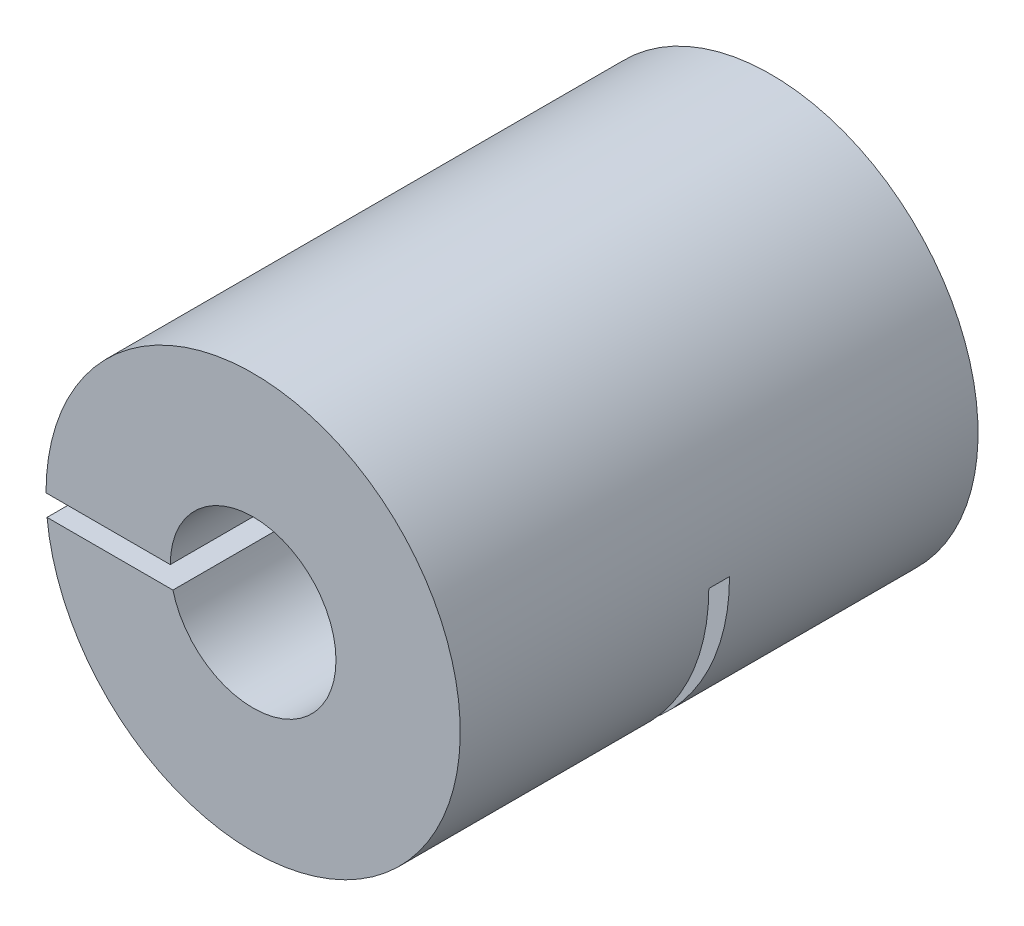
ISO-10303-21;
HEADER;
FILE_DESCRIPTION(('STEP AP214'),'2;1');
FILE_NAME('part.step','',(''),(''),'','','');
FILE_SCHEMA(('AUTOMOTIVE_DESIGN { 1 0 10303 214 1 1 1 1 }'));
ENDSEC;
DATA;
#1=APPLICATION_CONTEXT('core data for automotive mechanical design processes');
#2=APPLICATION_PROTOCOL_DEFINITION('international standard','automotive_design',2000,#1);
#3=PRODUCT_CONTEXT('',#1,'mechanical');
#4=PRODUCT('Part','Part','',(#3));
#5=PRODUCT_RELATED_PRODUCT_CATEGORY('part','',(#4));
#6=PRODUCT_DEFINITION_FORMATION('','',#4);
#7=PRODUCT_DEFINITION_CONTEXT('part definition',#1,'design');
#8=PRODUCT_DEFINITION('design','',#6,#7);
#9=PRODUCT_DEFINITION_SHAPE('','',#8);
#10=(LENGTH_UNIT() NAMED_UNIT(*) SI_UNIT(.MILLI.,.METRE.));
#11=(NAMED_UNIT(*) PLANE_ANGLE_UNIT() SI_UNIT($,.RADIAN.));
#12=(NAMED_UNIT(*) SI_UNIT($,.STERADIAN.) SOLID_ANGLE_UNIT());
#13=UNCERTAINTY_MEASURE_WITH_UNIT(LENGTH_MEASURE(1.E-05),#10,'distance_accuracy_value','');
#14=(GEOMETRIC_REPRESENTATION_CONTEXT(3) GLOBAL_UNCERTAINTY_ASSIGNED_CONTEXT((#13)) GLOBAL_UNIT_ASSIGNED_CONTEXT((#10,
#11,#12)) REPRESENTATION_CONTEXT('',''));
#15=CARTESIAN_POINT('',(0.,0.,0.));
#16=DIRECTION('',(0.,0.,1.));
#17=DIRECTION('',(1.,0.,0.));
#18=AXIS2_PLACEMENT_3D('',#15,#16,#17);
#19=CARTESIAN_POINT('',(0.,0.,0.));
#20=DIRECTION('',(0.,1.,0.));
#21=DIRECTION('',(0.,0.,1.));
#22=AXIS2_PLACEMENT_3D('',#19,#20,#21);
#23=PLANE('',#22);
#24=DIRECTION('',(-1.,0.,0.));
#25=VECTOR('',#24,1.);
#26=CARTESIAN_POINT('',(0.,0.,0.));
#27=LINE('',#26,#25);
#28=CARTESIAN_POINT('',(4.,0.,0.));
#29=VERTEX_POINT('',#28);
#30=CARTESIAN_POINT('',(2.5,0.,0.));
#31=VERTEX_POINT('',#30);
#32=EDGE_CURVE('E176',#29,#31,#27,.T.);
#33=ORIENTED_EDGE('',*,*,#32,.T.);
#34=DIRECTION('',(0.,0.,-1.));
#35=VECTOR('',#34,1.);
#36=CARTESIAN_POINT('',(2.5,0.,12.5));
#37=LINE('',#36,#35);
#38=CARTESIAN_POINT('',(2.5,0.,-0.5));
#39=VERTEX_POINT('',#38);
#40=EDGE_CURVE('E208',#31,#39,#37,.T.);
#41=ORIENTED_EDGE('',*,*,#40,.T.);
#42=DIRECTION('',(-1.,0.,0.));
#43=VECTOR('',#42,1.);
#44=CARTESIAN_POINT('',(-26.5245924460657,0.,-0.5));
#45=LINE('',#44,#43);
#46=CARTESIAN_POINT('',(10.,0.,-0.5));
#47=VERTEX_POINT('',#46);
#48=EDGE_CURVE('E146',#47,#39,#45,.T.);
#49=ORIENTED_EDGE('',*,*,#48,.F.);
#50=DIRECTION('',(0.,0.,1.));
#51=VECTOR('',#50,1.);
#52=CARTESIAN_POINT('',(10.,0.,-12.5));
#53=LINE('',#52,#51);
#54=CARTESIAN_POINT('',(9.99999999999999,0.,0.5));
#55=VERTEX_POINT('',#54);
#56=EDGE_CURVE('E158',#47,#55,#53,.T.);
#57=ORIENTED_EDGE('',*,*,#56,.T.);
#58=DIRECTION('',(1.,0.,0.));
#59=VECTOR('',#58,1.);
#60=CARTESIAN_POINT('',(-26.5245924460657,0.,0.5));
#61=LINE('',#60,#59);
#62=CARTESIAN_POINT('',(3.99999999999999,0.,0.5));
#63=VERTEX_POINT('',#62);
#64=EDGE_CURVE('E149',#63,#55,#61,.T.);
#65=ORIENTED_EDGE('',*,*,#64,.F.);
#66=DIRECTION('',(0.,0.,1.));
#67=VECTOR('',#66,1.);
#68=CARTESIAN_POINT('',(4.,0.,0.));
#69=LINE('',#68,#67);
#70=EDGE_CURVE('E152',#29,#63,#69,.T.);
#71=ORIENTED_EDGE('',*,*,#70,.F.);
#72=EDGE_LOOP('',(#33,#41,#49,#57,#65,#71));
#73=FACE_BOUND('',#72,.T.);
#74=ADVANCED_FACE('F36',(#73),#23,.F.);
#75=CARTESIAN_POINT('',(0.,0.,-12.5));
#76=DIRECTION('',(0.,0.,1.));
#77=DIRECTION('',(1.,0.,0.));
#78=AXIS2_PLACEMENT_3D('',#75,#76,#77);
#79=CYLINDRICAL_SURFACE('',#78,10.);
#80=DIRECTION('',(0.,0.,1.));
#81=VECTOR('',#80,1.);
#82=CARTESIAN_POINT('',(-9.9498743710662,-1.,-12.5));
#83=LINE('',#82,#81);
#84=CARTESIAN_POINT('',(-9.9498743710662,-1.,-12.5));
#85=VERTEX_POINT('',#84);
#86=CARTESIAN_POINT('',(-9.9498743710662,-1.,-0.5));
#87=VERTEX_POINT('',#86);
#88=EDGE_CURVE('E134',#85,#87,#83,.T.);
#89=ORIENTED_EDGE('',*,*,#88,.F.);
#90=CARTESIAN_POINT('',(0.,0.,-12.5));
#91=DIRECTION('',(0.,0.,1.));
#92=DIRECTION('',(1.,0.,0.));
#93=AXIS2_PLACEMENT_3D('',#90,#91,#92);
#94=CIRCLE('',#93,10.);
#95=CARTESIAN_POINT('',(-10.,0.,-12.5));
#96=VERTEX_POINT('',#95);
#97=EDGE_CURVE('E171',#85,#96,#94,.T.);
#98=ORIENTED_EDGE('',*,*,#97,.T.);
#99=DIRECTION('',(0.,0.,1.));
#100=VECTOR('',#99,1.);
#101=CARTESIAN_POINT('',(-10.,0.,-12.5));
#102=LINE('',#101,#100);
#103=CARTESIAN_POINT('',(-10.,0.,12.5));
#104=VERTEX_POINT('',#103);
#105=EDGE_CURVE('E130',#104,#96,#102,.F.);
#106=ORIENTED_EDGE('',*,*,#105,.F.);
#107=CARTESIAN_POINT('',(0.,0.,12.5));
#108=DIRECTION('',(0.,0.,1.));
#109=DIRECTION('',(1.,0.,0.));
#110=AXIS2_PLACEMENT_3D('',#107,#108,#109);
#111=CIRCLE('',#110,10.);
#112=CARTESIAN_POINT('',(-9.9498743710662,-1.,12.5));
#113=VERTEX_POINT('',#112);
#114=EDGE_CURVE('E168',#113,#104,#111,.T.);
#115=ORIENTED_EDGE('',*,*,#114,.F.);
#116=CARTESIAN_POINT('',(-9.9498743710662,-1.,0.5));
#117=VERTEX_POINT('',#116);
#118=EDGE_CURVE('E143',#117,#113,#83,.T.);
#119=ORIENTED_EDGE('',*,*,#118,.F.);
#120=CARTESIAN_POINT('',(0.,0.,0.5));
#121=DIRECTION('',(0.,0.,1.));
#122=DIRECTION('',(1.,0.,0.));
#123=AXIS2_PLACEMENT_3D('',#120,#121,#122);
#124=CIRCLE('',#123,10.);
#125=EDGE_CURVE('E161',#55,#117,#124,.F.);
#126=ORIENTED_EDGE('',*,*,#125,.F.);
#127=ORIENTED_EDGE('',*,*,#56,.F.);
#128=CARTESIAN_POINT('',(0.,0.,-0.5));
#129=DIRECTION('',(0.,0.,-1.));
#130=DIRECTION('',(-1.,0.,0.));
#131=AXIS2_PLACEMENT_3D('',#128,#129,#130);
#132=CIRCLE('',#131,10.);
#133=EDGE_CURVE('E182',#87,#47,#132,.F.);
#134=ORIENTED_EDGE('',*,*,#133,.F.);
#135=EDGE_LOOP('',(#89,#98,#106,#115,#119,#126,#127,#134));
#136=FACE_BOUND('',#135,.T.);
#137=ADVANCED_FACE('F38',(#136),#79,.T.);
#138=CARTESIAN_POINT('',(0.,0.,-12.5));
#139=DIRECTION('',(0.,0.,1.));
#140=DIRECTION('',(1.,0.,0.));
#141=AXIS2_PLACEMENT_3D('',#138,#139,#140);
#142=PLANE('',#141);
#143=DIRECTION('',(1.,0.,0.));
#144=VECTOR('',#143,1.);
#145=CARTESIAN_POINT('',(0.,-1.,-12.5));
#146=LINE('',#145,#144);
#147=CARTESIAN_POINT('',(-2.29128784747792,-1.,-12.5));
#148=VERTEX_POINT('',#147);
#149=EDGE_CURVE('E125',#85,#148,#146,.T.);
#150=ORIENTED_EDGE('',*,*,#149,.T.);
#151=CARTESIAN_POINT('',(0.,0.,-12.5));
#152=DIRECTION('',(0.,0.,-1.));
#153=DIRECTION('',(-1.,0.,0.));
#154=AXIS2_PLACEMENT_3D('',#151,#152,#153);
#155=CIRCLE('',#154,2.5);
#156=CARTESIAN_POINT('',(-2.5,0.,-12.5));
#157=VERTEX_POINT('',#156);
#158=EDGE_CURVE('E51',#157,#148,#155,.T.);
#159=ORIENTED_EDGE('',*,*,#158,.F.);
#160=DIRECTION('',(-1.,0.,0.));
#161=VECTOR('',#160,1.);
#162=CARTESIAN_POINT('',(0.,0.,-12.5));
#163=LINE('',#162,#161);
#164=EDGE_CURVE('E123',#157,#96,#163,.T.);
#165=ORIENTED_EDGE('',*,*,#164,.T.);
#166=ORIENTED_EDGE('',*,*,#97,.F.);
#167=EDGE_LOOP('',(#150,#159,#165,#166));
#168=FACE_BOUND('',#167,.T.);
#169=ADVANCED_FACE('F121',(#168),#142,.F.);
#170=CARTESIAN_POINT('',(0.,0.,12.5));
#171=DIRECTION('',(0.,0.,1.));
#172=DIRECTION('',(1.,0.,0.));
#173=AXIS2_PLACEMENT_3D('',#170,#171,#172);
#174=PLANE('',#173);
#175=DIRECTION('',(1.,0.,0.));
#176=VECTOR('',#175,1.);
#177=CARTESIAN_POINT('',(0.,-1.,12.5));
#178=LINE('',#177,#176);
#179=CARTESIAN_POINT('',(-3.87298334620742,-1.,12.5));
#180=VERTEX_POINT('',#179);
#181=EDGE_CURVE('E132',#113,#180,#178,.T.);
#182=ORIENTED_EDGE('',*,*,#181,.F.);
#183=ORIENTED_EDGE('',*,*,#114,.T.);
#184=DIRECTION('',(-1.,0.,0.));
#185=VECTOR('',#184,1.);
#186=CARTESIAN_POINT('',(0.,0.,12.5));
#187=LINE('',#186,#185);
#188=CARTESIAN_POINT('',(-4.,0.,12.5));
#189=VERTEX_POINT('',#188);
#190=EDGE_CURVE('E117',#189,#104,#187,.T.);
#191=ORIENTED_EDGE('',*,*,#190,.F.);
#192=CARTESIAN_POINT('',(0.,0.,12.5));
#193=DIRECTION('',(0.,0.,1.));
#194=DIRECTION('',(1.,0.,0.));
#195=AXIS2_PLACEMENT_3D('',#192,#193,#194);
#196=CIRCLE('',#195,4.);
#197=EDGE_CURVE('E164',#180,#189,#196,.T.);
#198=ORIENTED_EDGE('',*,*,#197,.F.);
#199=EDGE_LOOP('',(#182,#183,#191,#198));
#200=FACE_BOUND('',#199,.T.);
#201=ADVANCED_FACE('F214',(#200),#174,.T.);
#202=CARTESIAN_POINT('',(0.,0.,0.));
#203=DIRECTION('',(0.,0.,1.));
#204=DIRECTION('',(1.,0.,0.));
#205=AXIS2_PLACEMENT_3D('',#202,#203,#204);
#206=CYLINDRICAL_SURFACE('',#205,4.);
#207=CARTESIAN_POINT('',(0.,0.,0.5));
#208=DIRECTION('',(0.,0.,1.));
#209=DIRECTION('',(1.,0.,0.));
#210=AXIS2_PLACEMENT_3D('',#207,#208,#209);
#211=CIRCLE('',#210,4.);
#212=CARTESIAN_POINT('',(-3.87298334620742,-1.,0.5));
#213=VERTEX_POINT('',#212);
#214=EDGE_CURVE('E179',#63,#213,#211,.F.);
#215=ORIENTED_EDGE('',*,*,#214,.T.);
#216=DIRECTION('',(0.,0.,1.));
#217=VECTOR('',#216,1.);
#218=CARTESIAN_POINT('',(-3.87298334620742,-1.,0.));
#219=LINE('',#218,#217);
#220=EDGE_CURVE('E58',#213,#180,#219,.T.);
#221=ORIENTED_EDGE('',*,*,#220,.T.);
#222=ORIENTED_EDGE('',*,*,#197,.T.);
#223=DIRECTION('',(0.,0.,1.));
#224=VECTOR('',#223,1.);
#225=CARTESIAN_POINT('',(-4.,0.,0.));
#226=LINE('',#225,#224);
#227=CARTESIAN_POINT('',(-4.,0.,0.));
#228=VERTEX_POINT('',#227);
#229=EDGE_CURVE('E155',#189,#228,#226,.F.);
#230=ORIENTED_EDGE('',*,*,#229,.T.);
#231=CARTESIAN_POINT('',(0.,0.,0.));
#232=DIRECTION('',(0.,0.,1.));
#233=DIRECTION('',(1.,0.,0.));
#234=AXIS2_PLACEMENT_3D('',#231,#232,#233);
#235=CIRCLE('',#234,4.);
#236=EDGE_CURVE('E165',#29,#228,#235,.T.);
#237=ORIENTED_EDGE('',*,*,#236,.F.);
#238=ORIENTED_EDGE('',*,*,#70,.T.);
#239=EDGE_LOOP('',(#215,#221,#222,#230,#237,#238));
#240=FACE_BOUND('',#239,.T.);
#241=ADVANCED_FACE('F202',(#240),#206,.F.);
#242=CARTESIAN_POINT('',(0.,0.,0.));
#243=DIRECTION('',(0.,0.,1.));
#244=DIRECTION('',(1.,0.,0.));
#245=AXIS2_PLACEMENT_3D('',#242,#243,#244);
#246=PLANE('',#245);
#247=CARTESIAN_POINT('',(0.,0.,0.));
#248=DIRECTION('',(0.,0.,1.));
#249=DIRECTION('',(1.,0.,0.));
#250=AXIS2_PLACEMENT_3D('',#247,#248,#249);
#251=CIRCLE('',#250,2.5);
#252=CARTESIAN_POINT('',(-2.5,0.,0.));
#253=VERTEX_POINT('',#252);
#254=EDGE_CURVE('E113',#31,#253,#251,.T.);
#255=ORIENTED_EDGE('',*,*,#254,.F.);
#256=ORIENTED_EDGE('',*,*,#32,.F.);
#257=ORIENTED_EDGE('',*,*,#236,.T.);
#258=EDGE_CURVE('E173',#253,#228,#27,.T.);
#259=ORIENTED_EDGE('',*,*,#258,.F.);
#260=EDGE_LOOP('',(#255,#256,#257,#259));
#261=FACE_BOUND('',#260,.T.);
#262=ADVANCED_FACE('F207',(#261),#246,.T.);
#263=CARTESIAN_POINT('',(-26.5245924460657,-25.,0.5));
#264=DIRECTION('',(0.,0.,1.));
#265=DIRECTION('',(1.,0.,0.));
#266=AXIS2_PLACEMENT_3D('',#263,#264,#265);
#267=PLANE('',#266);
#268=ORIENTED_EDGE('',*,*,#125,.T.);
#269=DIRECTION('',(1.,0.,0.));
#270=VECTOR('',#269,1.);
#271=CARTESIAN_POINT('',(-26.5245924460657,-1.,0.5));
#272=LINE('',#271,#270);
#273=EDGE_CURVE('E142',#117,#213,#272,.T.);
#274=ORIENTED_EDGE('',*,*,#273,.T.);
#275=ORIENTED_EDGE('',*,*,#214,.F.);
#276=ORIENTED_EDGE('',*,*,#64,.T.);
#277=EDGE_LOOP('',(#268,#274,#275,#276));
#278=FACE_BOUND('',#277,.T.);
#279=ADVANCED_FACE('F200',(#278),#267,.F.);
#280=ORIENTED_EDGE('',*,*,#164,.F.);
#281=DIRECTION('',(0.,0.,-1.));
#282=VECTOR('',#281,1.);
#283=CARTESIAN_POINT('',(-2.5,0.,12.5));
#284=LINE('',#283,#282);
#285=EDGE_CURVE('E110',#157,#253,#284,.F.);
#286=ORIENTED_EDGE('',*,*,#285,.T.);
#287=ORIENTED_EDGE('',*,*,#258,.T.);
#288=ORIENTED_EDGE('',*,*,#229,.F.);
#289=ORIENTED_EDGE('',*,*,#190,.T.);
#290=ORIENTED_EDGE('',*,*,#105,.T.);
#291=EDGE_LOOP('',(#280,#286,#287,#288,#289,#290));
#292=FACE_BOUND('',#291,.T.);
#293=ADVANCED_FACE('F128',(#292),#23,.F.);
#294=CARTESIAN_POINT('',(-26.5245924460657,-25.,-0.5));
#295=DIRECTION('',(0.,0.,-1.));
#296=DIRECTION('',(-1.,0.,0.));
#297=AXIS2_PLACEMENT_3D('',#294,#295,#296);
#298=PLANE('',#297);
#299=ORIENTED_EDGE('',*,*,#48,.T.);
#300=CARTESIAN_POINT('',(0.,0.,-0.5));
#301=DIRECTION('',(0.,0.,-1.));
#302=DIRECTION('',(-1.,0.,0.));
#303=AXIS2_PLACEMENT_3D('',#300,#301,#302);
#304=CIRCLE('',#303,2.5);
#305=CARTESIAN_POINT('',(-2.29128784747792,-1.,-0.5));
#306=VERTEX_POINT('',#305);
#307=EDGE_CURVE('E126',#39,#306,#304,.T.);
#308=ORIENTED_EDGE('',*,*,#307,.T.);
#309=DIRECTION('',(-1.,0.,0.));
#310=VECTOR('',#309,1.);
#311=CARTESIAN_POINT('',(-26.5245924460657,-1.,-0.5));
#312=LINE('',#311,#310);
#313=EDGE_CURVE('E44',#306,#87,#312,.T.);
#314=ORIENTED_EDGE('',*,*,#313,.T.);
#315=ORIENTED_EDGE('',*,*,#133,.T.);
#316=EDGE_LOOP('',(#299,#308,#314,#315));
#317=FACE_BOUND('',#316,.T.);
#318=ADVANCED_FACE('F186',(#317),#298,.F.);
#319=CARTESIAN_POINT('',(0.,-1.,-12.5));
#320=DIRECTION('',(0.,-1.,0.));
#321=DIRECTION('',(1.,0.,0.));
#322=AXIS2_PLACEMENT_3D('',#319,#320,#321);
#323=PLANE('',#322);
#324=ORIENTED_EDGE('',*,*,#313,.F.);
#325=DIRECTION('',(0.,0.,-1.));
#326=VECTOR('',#325,1.);
#327=CARTESIAN_POINT('',(-2.29128784747792,-1.,12.5));
#328=LINE('',#327,#326);
#329=EDGE_CURVE('E11',#306,#148,#328,.T.);
#330=ORIENTED_EDGE('',*,*,#329,.T.);
#331=ORIENTED_EDGE('',*,*,#149,.F.);
#332=ORIENTED_EDGE('',*,*,#88,.T.);
#333=EDGE_LOOP('',(#324,#330,#331,#332));
#334=FACE_BOUND('',#333,.T.);
#335=ADVANCED_FACE('F191',(#334),#323,.F.);
#336=ORIENTED_EDGE('',*,*,#118,.T.);
#337=ORIENTED_EDGE('',*,*,#181,.T.);
#338=ORIENTED_EDGE('',*,*,#220,.F.);
#339=ORIENTED_EDGE('',*,*,#273,.F.);
#340=EDGE_LOOP('',(#336,#337,#338,#339));
#341=FACE_BOUND('',#340,.T.);
#342=ADVANCED_FACE('F216',(#341),#323,.F.);
#343=CARTESIAN_POINT('',(0.,0.,12.5));
#344=DIRECTION('',(0.,0.,-1.));
#345=DIRECTION('',(-1.,0.,0.));
#346=AXIS2_PLACEMENT_3D('',#343,#344,#345);
#347=CYLINDRICAL_SURFACE('',#346,2.5);
#348=ORIENTED_EDGE('',*,*,#158,.T.);
#349=ORIENTED_EDGE('',*,*,#329,.F.);
#350=ORIENTED_EDGE('',*,*,#307,.F.);
#351=ORIENTED_EDGE('',*,*,#40,.F.);
#352=ORIENTED_EDGE('',*,*,#254,.T.);
#353=ORIENTED_EDGE('',*,*,#285,.F.);
#354=EDGE_LOOP('',(#348,#349,#350,#351,#352,#353));
#355=FACE_BOUND('',#354,.T.);
#356=ADVANCED_FACE('F111',(#355),#347,.F.);
#357=CLOSED_SHELL('',(#74,#137,#169,#201,#241,#262,#279,#293,#318,#335,#342,#356));
#358=MANIFOLD_SOLID_BREP('B2',#357);
#359=ADVANCED_BREP_SHAPE_REPRESENTATION('',(#18,#358),#14);
#360=SHAPE_DEFINITION_REPRESENTATION(#9,#359);
ENDSEC;
END-ISO-10303-21;
